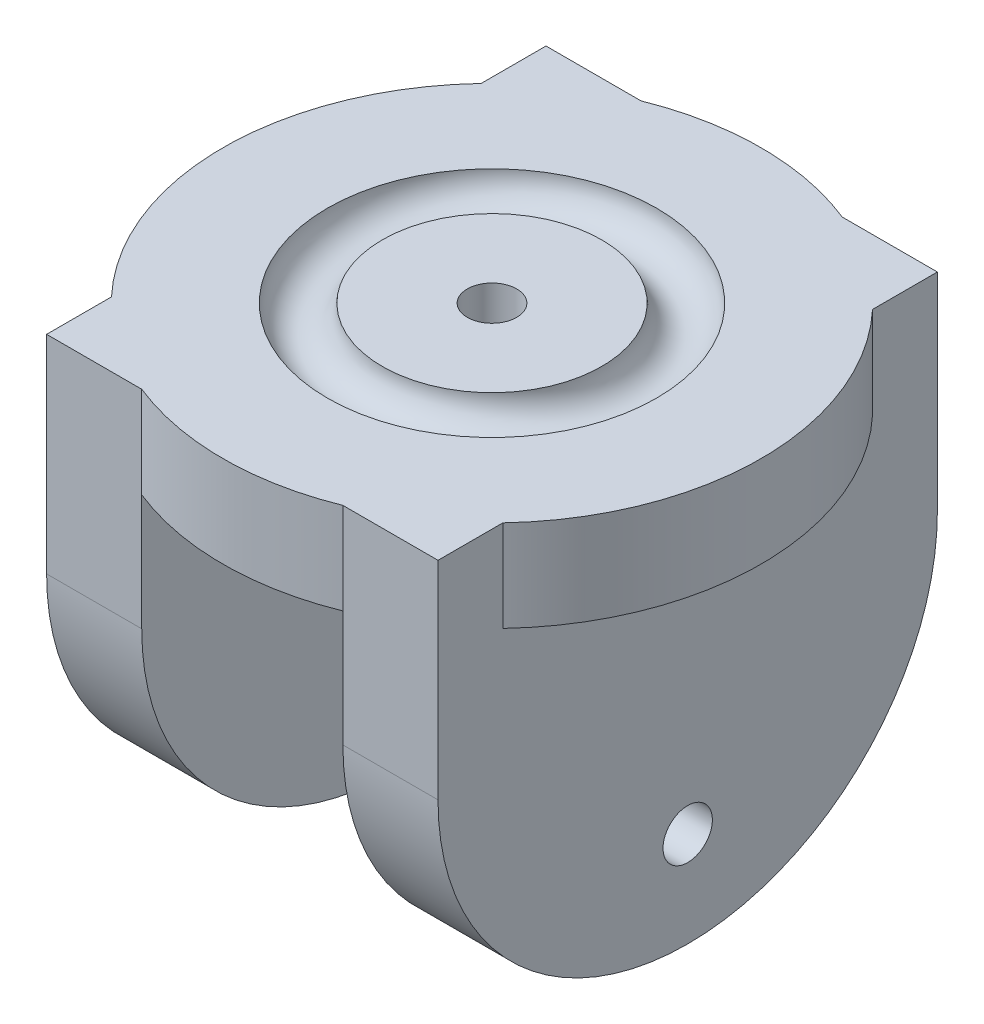
ISO-10303-21;
HEADER;
FILE_DESCRIPTION(('STEP AP214'),'2;1');
FILE_NAME('part.step','',(''),(''),'','','');
FILE_SCHEMA(('AUTOMOTIVE_DESIGN { 1 0 10303 214 1 1 1 1 }'));
ENDSEC;
DATA;
#1=APPLICATION_CONTEXT('core data for automotive mechanical design processes');
#2=APPLICATION_PROTOCOL_DEFINITION('international standard','automotive_design',2000,#1);
#3=PRODUCT_CONTEXT('',#1,'mechanical');
#4=PRODUCT('Part','Part','',(#3));
#5=PRODUCT_RELATED_PRODUCT_CATEGORY('part','',(#4));
#6=PRODUCT_DEFINITION_FORMATION('','',#4);
#7=PRODUCT_DEFINITION_CONTEXT('part definition',#1,'design');
#8=PRODUCT_DEFINITION('design','',#6,#7);
#9=PRODUCT_DEFINITION_SHAPE('','',#8);
#10=(LENGTH_UNIT() NAMED_UNIT(*) SI_UNIT(.MILLI.,.METRE.));
#11=(NAMED_UNIT(*) PLANE_ANGLE_UNIT() SI_UNIT($,.RADIAN.));
#12=(NAMED_UNIT(*) SI_UNIT($,.STERADIAN.) SOLID_ANGLE_UNIT());
#13=UNCERTAINTY_MEASURE_WITH_UNIT(LENGTH_MEASURE(1.E-05),#10,'distance_accuracy_value','');
#14=(GEOMETRIC_REPRESENTATION_CONTEXT(3) GLOBAL_UNCERTAINTY_ASSIGNED_CONTEXT((#13)) GLOBAL_UNIT_ASSIGNED_CONTEXT((#10,
#11,#12)) REPRESENTATION_CONTEXT('',''));
#15=CARTESIAN_POINT('',(0.,0.,0.));
#16=DIRECTION('',(0.,0.,1.));
#17=DIRECTION('',(1.,0.,0.));
#18=AXIS2_PLACEMENT_3D('',#15,#16,#17);
#19=CARTESIAN_POINT('',(-11.,65.5996002706022,-27.3088133507909));
#20=DIRECTION('',(1.,0.,0.));
#21=DIRECTION('',(0.,0.,-1.));
#22=AXIS2_PLACEMENT_3D('',#19,#20,#21);
#23=PLANE('',#22);
#24=CARTESIAN_POINT('',(-11.,-29.5844424914264,0.));
#25=DIRECTION('',(1.,0.,0.));
#26=DIRECTION('',(0.,0.,-1.));
#27=AXIS2_PLACEMENT_3D('',#24,#25,#26);
#28=CIRCLE('',#27,2.7);
#29=CARTESIAN_POINT('',(-11.,-29.5844424914264,-2.7));
#30=VERTEX_POINT('',#29);
#31=EDGE_CURVE('E366',#30,#30,#28,.T.);
#32=ORIENTED_EDGE('',*,*,#31,.F.);
#33=EDGE_LOOP('',(#32));
#34=FACE_BOUND('',#33,.T.);
#35=CARTESIAN_POINT('',(-11.,-12.691186649209,0.));
#36=DIRECTION('',(1.,0.,0.));
#37=DIRECTION('',(0.,0.,-1.));
#38=AXIS2_PLACEMENT_3D('',#35,#36,#37);
#39=CIRCLE('',#38,27.308813350791);
#40=CARTESIAN_POINT('',(-11.,-12.691186649209,-27.3088133507909));
#41=VERTEX_POINT('',#40);
#42=CARTESIAN_POINT('',(-11.,-12.691186649209,27.3088133507911));
#43=VERTEX_POINT('',#42);
#44=EDGE_CURVE('E141',#41,#43,#39,.F.);
#45=ORIENTED_EDGE('',*,*,#44,.F.);
#46=DIRECTION('',(0.,-1.,0.));
#47=VECTOR('',#46,1.);
#48=CARTESIAN_POINT('',(-11.,65.5996002706022,-27.3088133507909));
#49=LINE('',#48,#47);
#50=CARTESIAN_POINT('',(-11.,0.,-27.3088133507909));
#51=VERTEX_POINT('',#50);
#52=EDGE_CURVE('E177',#51,#41,#49,.T.);
#53=ORIENTED_EDGE('',*,*,#52,.F.);
#54=DIRECTION('',(0.,0.,-1.));
#55=VECTOR('',#54,1.);
#56=CARTESIAN_POINT('',(-11.,0.,0.));
#57=LINE('',#56,#55);
#58=CARTESIAN_POINT('',(-11.,0.,27.3088133507911));
#59=VERTEX_POINT('',#58);
#60=EDGE_CURVE('E198',#59,#51,#57,.T.);
#61=ORIENTED_EDGE('',*,*,#60,.F.);
#62=DIRECTION('',(0.,-1.,0.));
#63=VECTOR('',#62,1.);
#64=CARTESIAN_POINT('',(-11.,65.5996002706022,27.3088133507911));
#65=LINE('',#64,#63);
#66=EDGE_CURVE('E172',#59,#43,#65,.T.);
#67=ORIENTED_EDGE('',*,*,#66,.T.);
#68=EDGE_LOOP('',(#45,#53,#61,#67));
#69=FACE_BOUND('',#68,.T.);
#70=ADVANCED_FACE('F33',(#34,#69),#23,.T.);
#71=CARTESIAN_POINT('',(-21.403384244436,65.5996002706022,27.3088133507911));
#72=DIRECTION('',(-1.,0.,0.));
#73=DIRECTION('',(0.,0.,1.));
#74=AXIS2_PLACEMENT_3D('',#71,#72,#73);
#75=PLANE('',#74);
#76=CARTESIAN_POINT('',(-21.403384244436,-29.5844424914264,0.));
#77=DIRECTION('',(-1.,0.,0.));
#78=DIRECTION('',(0.,0.,1.));
#79=AXIS2_PLACEMENT_3D('',#76,#77,#78);
#80=CIRCLE('',#79,2.7);
#81=CARTESIAN_POINT('',(-21.403384244436,-29.5844424914264,2.7));
#82=VERTEX_POINT('',#81);
#83=EDGE_CURVE('E204',#82,#82,#80,.T.);
#84=ORIENTED_EDGE('',*,*,#83,.F.);
#85=EDGE_LOOP('',(#84));
#86=FACE_BOUND('',#85,.T.);
#87=CARTESIAN_POINT('',(-21.403384244436,-12.691186649209,0.));
#88=DIRECTION('',(1.,0.,0.));
#89=DIRECTION('',(0.,0.,1.));
#90=AXIS2_PLACEMENT_3D('',#87,#88,#89);
#91=CIRCLE('',#90,27.308813350791);
#92=CARTESIAN_POINT('',(-21.403384244436,-12.691186649209,27.3088133507911));
#93=VERTEX_POINT('',#92);
#94=CARTESIAN_POINT('',(-21.403384244436,-12.691186649209,-27.3088133507909));
#95=VERTEX_POINT('',#94);
#96=EDGE_CURVE('E48',#93,#95,#91,.T.);
#97=ORIENTED_EDGE('',*,*,#96,.F.);
#98=DIRECTION('',(0.,-1.,0.));
#99=VECTOR('',#98,1.);
#100=CARTESIAN_POINT('',(-21.403384244436,65.5996002706022,27.3088133507911));
#101=LINE('',#100,#99);
#102=CARTESIAN_POINT('',(-21.403384244436,10.,27.3088133507911));
#103=VERTEX_POINT('',#102);
#104=EDGE_CURVE('E153',#103,#93,#101,.T.);
#105=ORIENTED_EDGE('',*,*,#104,.F.);
#106=DIRECTION('',(0.,0.,-1.));
#107=VECTOR('',#106,1.);
#108=CARTESIAN_POINT('',(-21.403384244436,10.,27.3088133507911));
#109=LINE('',#108,#107);
#110=CARTESIAN_POINT('',(-21.403384244436,10.,20.2154997344455));
#111=VERTEX_POINT('',#110);
#112=EDGE_CURVE('E164',#103,#111,#109,.T.);
#113=ORIENTED_EDGE('',*,*,#112,.T.);
#114=DIRECTION('',(0.,-1.,0.));
#115=VECTOR('',#114,1.);
#116=CARTESIAN_POINT('',(-21.403384244436,10.,20.2154997344455));
#117=LINE('',#116,#115);
#118=CARTESIAN_POINT('',(-21.403384244436,0.,20.2154997344455));
#119=VERTEX_POINT('',#118);
#120=EDGE_CURVE('E176',#119,#111,#117,.F.);
#121=ORIENTED_EDGE('',*,*,#120,.F.);
#122=DIRECTION('',(0.,0.,1.));
#123=VECTOR('',#122,1.);
#124=CARTESIAN_POINT('',(-21.403384244436,0.,0.));
#125=LINE('',#124,#123);
#126=CARTESIAN_POINT('',(-21.403384244436,0.,-20.2154997344455));
#127=VERTEX_POINT('',#126);
#128=EDGE_CURVE('E195',#127,#119,#125,.T.);
#129=ORIENTED_EDGE('',*,*,#128,.F.);
#130=DIRECTION('',(0.,-1.,0.));
#131=VECTOR('',#130,1.);
#132=CARTESIAN_POINT('',(-21.403384244436,10.,-20.2154997344455));
#133=LINE('',#132,#131);
#134=CARTESIAN_POINT('',(-21.403384244436,10.,-20.2154997344455));
#135=VERTEX_POINT('',#134);
#136=EDGE_CURVE('E180',#135,#127,#133,.T.);
#137=ORIENTED_EDGE('',*,*,#136,.F.);
#138=CARTESIAN_POINT('',(-21.403384244436,10.,-27.3088133507909));
#139=VERTEX_POINT('',#138);
#140=EDGE_CURVE('E162',#135,#139,#109,.T.);
#141=ORIENTED_EDGE('',*,*,#140,.T.);
#142=DIRECTION('',(0.,-1.,0.));
#143=VECTOR('',#142,1.);
#144=CARTESIAN_POINT('',(-21.403384244436,65.5996002706022,-27.3088133507909));
#145=LINE('',#144,#143);
#146=EDGE_CURVE('E156',#139,#95,#145,.T.);
#147=ORIENTED_EDGE('',*,*,#146,.T.);
#148=EDGE_LOOP('',(#97,#105,#113,#121,#129,#137,#141,#147));
#149=FACE_BOUND('',#148,.T.);
#150=ADVANCED_FACE('F152',(#86,#149),#75,.T.);
#151=CARTESIAN_POINT('',(21.403384244436,65.5996002706022,27.308813350791));
#152=DIRECTION('',(1.,0.,0.));
#153=DIRECTION('',(0.,0.,-1.));
#154=AXIS2_PLACEMENT_3D('',#151,#152,#153);
#155=PLANE('',#154);
#156=CARTESIAN_POINT('',(21.403384244436,-29.5844424914264,0.));
#157=DIRECTION('',(1.,0.,0.));
#158=DIRECTION('',(0.,0.,-1.));
#159=AXIS2_PLACEMENT_3D('',#156,#157,#158);
#160=CIRCLE('',#159,2.7);
#161=CARTESIAN_POINT('',(21.403384244436,-29.5844424914264,-2.7));
#162=VERTEX_POINT('',#161);
#163=EDGE_CURVE('E205',#162,#162,#160,.T.);
#164=ORIENTED_EDGE('',*,*,#163,.F.);
#165=EDGE_LOOP('',(#164));
#166=FACE_BOUND('',#165,.T.);
#167=CARTESIAN_POINT('',(21.403384244436,-12.691186649209,0.));
#168=DIRECTION('',(1.,0.,0.));
#169=DIRECTION('',(0.,0.,-1.));
#170=AXIS2_PLACEMENT_3D('',#167,#168,#169);
#171=CIRCLE('',#170,27.308813350791);
#172=CARTESIAN_POINT('',(21.403384244436,-12.691186649209,-27.3088133507909));
#173=VERTEX_POINT('',#172);
#174=CARTESIAN_POINT('',(21.403384244436,-12.691186649209,27.3088133507911));
#175=VERTEX_POINT('',#174);
#176=EDGE_CURVE('E282',#173,#175,#171,.F.);
#177=ORIENTED_EDGE('',*,*,#176,.F.);
#178=DIRECTION('',(0.,-1.,0.));
#179=VECTOR('',#178,1.);
#180=CARTESIAN_POINT('',(21.403384244436,65.5996002706022,-27.308813350791));
#181=LINE('',#180,#179);
#182=CARTESIAN_POINT('',(21.403384244436,10.,-27.308813350791));
#183=VERTEX_POINT('',#182);
#184=EDGE_CURVE('E306',#183,#173,#181,.T.);
#185=ORIENTED_EDGE('',*,*,#184,.F.);
#186=DIRECTION('',(0.,0.,1.));
#187=VECTOR('',#186,1.);
#188=CARTESIAN_POINT('',(21.403384244436,10.,27.308813350791));
#189=LINE('',#188,#187);
#190=CARTESIAN_POINT('',(21.403384244436,10.,-20.2154997344455));
#191=VERTEX_POINT('',#190);
#192=EDGE_CURVE('E298',#183,#191,#189,.T.);
#193=ORIENTED_EDGE('',*,*,#192,.T.);
#194=DIRECTION('',(0.,-1.,0.));
#195=VECTOR('',#194,1.);
#196=CARTESIAN_POINT('',(21.403384244436,10.,-20.2154997344455));
#197=LINE('',#196,#195);
#198=CARTESIAN_POINT('',(21.403384244436,0.,-20.2154997344455));
#199=VERTEX_POINT('',#198);
#200=EDGE_CURVE('E315',#199,#191,#197,.F.);
#201=ORIENTED_EDGE('',*,*,#200,.F.);
#202=DIRECTION('',(0.,0.,-1.));
#203=VECTOR('',#202,1.);
#204=CARTESIAN_POINT('',(21.403384244436,0.,0.));
#205=LINE('',#204,#203);
#206=CARTESIAN_POINT('',(21.403384244436,0.,20.2154997344455));
#207=VERTEX_POINT('',#206);
#208=EDGE_CURVE('E312',#207,#199,#205,.T.);
#209=ORIENTED_EDGE('',*,*,#208,.F.);
#210=DIRECTION('',(0.,-1.,0.));
#211=VECTOR('',#210,1.);
#212=CARTESIAN_POINT('',(21.403384244436,10.,20.2154997344455));
#213=LINE('',#212,#211);
#214=CARTESIAN_POINT('',(21.403384244436,10.,20.2154997344455));
#215=VERTEX_POINT('',#214);
#216=EDGE_CURVE('E318',#215,#207,#213,.T.);
#217=ORIENTED_EDGE('',*,*,#216,.F.);
#218=CARTESIAN_POINT('',(21.403384244436,10.,27.308813350791));
#219=VERTEX_POINT('',#218);
#220=EDGE_CURVE('E295',#215,#219,#189,.T.);
#221=ORIENTED_EDGE('',*,*,#220,.T.);
#222=DIRECTION('',(0.,-1.,0.));
#223=VECTOR('',#222,1.);
#224=CARTESIAN_POINT('',(21.403384244436,65.5996002706022,27.308813350791));
#225=LINE('',#224,#223);
#226=EDGE_CURVE('E291',#219,#175,#225,.T.);
#227=ORIENTED_EDGE('',*,*,#226,.T.);
#228=EDGE_LOOP('',(#177,#185,#193,#201,#209,#217,#221,#227));
#229=FACE_BOUND('',#228,.T.);
#230=ADVANCED_FACE('F236',(#166,#229),#155,.T.);
#231=CARTESIAN_POINT('',(11.,65.5996002706022,-27.308813350791));
#232=DIRECTION('',(-1.,0.,0.));
#233=DIRECTION('',(0.,0.,1.));
#234=AXIS2_PLACEMENT_3D('',#231,#232,#233);
#235=PLANE('',#234);
#236=CARTESIAN_POINT('',(11.,-29.5844424914264,0.));
#237=DIRECTION('',(-1.,0.,0.));
#238=DIRECTION('',(0.,0.,1.));
#239=AXIS2_PLACEMENT_3D('',#236,#237,#238);
#240=CIRCLE('',#239,2.7);
#241=CARTESIAN_POINT('',(11.,-29.5844424914264,2.7));
#242=VERTEX_POINT('',#241);
#243=EDGE_CURVE('E201',#242,#242,#240,.T.);
#244=ORIENTED_EDGE('',*,*,#243,.F.);
#245=EDGE_LOOP('',(#244));
#246=FACE_BOUND('',#245,.T.);
#247=CARTESIAN_POINT('',(11.,-12.691186649209,0.));
#248=DIRECTION('',(-1.,0.,0.));
#249=DIRECTION('',(0.,0.,1.));
#250=AXIS2_PLACEMENT_3D('',#247,#248,#249);
#251=CIRCLE('',#250,27.308813350791);
#252=CARTESIAN_POINT('',(11.,-12.691186649209,27.3088133507911));
#253=VERTEX_POINT('',#252);
#254=CARTESIAN_POINT('',(11.,-12.691186649209,-27.308813350791));
#255=VERTEX_POINT('',#254);
#256=EDGE_CURVE('E56',#253,#255,#251,.F.);
#257=ORIENTED_EDGE('',*,*,#256,.F.);
#258=DIRECTION('',(0.,-1.,0.));
#259=VECTOR('',#258,1.);
#260=CARTESIAN_POINT('',(11.,65.5996002706022,27.308813350791));
#261=LINE('',#260,#259);
#262=CARTESIAN_POINT('',(11.,0.,27.3088133507909));
#263=VERTEX_POINT('',#262);
#264=EDGE_CURVE('E293',#263,#253,#261,.T.);
#265=ORIENTED_EDGE('',*,*,#264,.F.);
#266=DIRECTION('',(0.,0.,1.));
#267=VECTOR('',#266,1.);
#268=CARTESIAN_POINT('',(11.,0.,0.));
#269=LINE('',#268,#267);
#270=CARTESIAN_POINT('',(11.,0.,-27.308813350791));
#271=VERTEX_POINT('',#270);
#272=EDGE_CURVE('E308',#271,#263,#269,.T.);
#273=ORIENTED_EDGE('',*,*,#272,.F.);
#274=DIRECTION('',(0.,-1.,0.));
#275=VECTOR('',#274,1.);
#276=CARTESIAN_POINT('',(11.,65.5996002706022,-27.308813350791));
#277=LINE('',#276,#275);
#278=EDGE_CURVE('E351',#271,#255,#277,.T.);
#279=ORIENTED_EDGE('',*,*,#278,.T.);
#280=EDGE_LOOP('',(#257,#265,#273,#279));
#281=FACE_BOUND('',#280,.T.);
#282=ADVANCED_FACE('F227',(#246,#281),#235,.T.);
#283=CARTESIAN_POINT('',(0.,10.,0.));
#284=DIRECTION('',(0.,1.,0.));
#285=DIRECTION('',(0.,0.,1.));
#286=AXIS2_PLACEMENT_3D('',#283,#284,#285);
#287=PLANE('',#286);
#288=CARTESIAN_POINT('',(0.,10.,0.));
#289=DIRECTION('',(0.,1.,0.));
#290=DIRECTION('',(0.,0.,1.));
#291=AXIS2_PLACEMENT_3D('',#288,#289,#290);
#292=CIRCLE('',#291,29.4409797158372);
#293=CARTESIAN_POINT('',(-11.,10.,27.3088133507911));
#294=VERTEX_POINT('',#293);
#295=CARTESIAN_POINT('',(11.,10.,27.308813350791));
#296=VERTEX_POINT('',#295);
#297=EDGE_CURVE('E184',#294,#296,#292,.T.);
#298=ORIENTED_EDGE('',*,*,#297,.T.);
#299=DIRECTION('',(-1.,0.,0.));
#300=VECTOR('',#299,1.);
#301=CARTESIAN_POINT('',(11.,10.,27.308813350791));
#302=LINE('',#301,#300);
#303=EDGE_CURVE('E297',#219,#296,#302,.T.);
#304=ORIENTED_EDGE('',*,*,#303,.F.);
#305=ORIENTED_EDGE('',*,*,#220,.F.);
#306=EDGE_CURVE('E188',#215,#191,#292,.T.);
#307=ORIENTED_EDGE('',*,*,#306,.T.);
#308=ORIENTED_EDGE('',*,*,#192,.F.);
#309=DIRECTION('',(1.,0.,0.));
#310=VECTOR('',#309,1.);
#311=CARTESIAN_POINT('',(21.403384244436,10.,-27.308813350791));
#312=LINE('',#311,#310);
#313=CARTESIAN_POINT('',(11.,10.,-27.308813350791));
#314=VERTEX_POINT('',#313);
#315=EDGE_CURVE('E309',#314,#183,#312,.T.);
#316=ORIENTED_EDGE('',*,*,#315,.F.);
#317=CARTESIAN_POINT('',(-11.,10.,-27.3088133507909));
#318=VERTEX_POINT('',#317);
#319=EDGE_CURVE('E189',#314,#318,#292,.T.);
#320=ORIENTED_EDGE('',*,*,#319,.T.);
#321=DIRECTION('',(1.,0.,0.));
#322=VECTOR('',#321,1.);
#323=CARTESIAN_POINT('',(-21.403384244436,10.,-27.3088133507909));
#324=LINE('',#323,#322);
#325=EDGE_CURVE('E321',#139,#318,#324,.T.);
#326=ORIENTED_EDGE('',*,*,#325,.F.);
#327=ORIENTED_EDGE('',*,*,#140,.F.);
#328=EDGE_CURVE('E187',#135,#111,#292,.T.);
#329=ORIENTED_EDGE('',*,*,#328,.T.);
#330=ORIENTED_EDGE('',*,*,#112,.F.);
#331=DIRECTION('',(-1.,0.,0.));
#332=VECTOR('',#331,1.);
#333=CARTESIAN_POINT('',(-11.,10.,27.3088133507911));
#334=LINE('',#333,#332);
#335=EDGE_CURVE('E161',#294,#103,#334,.T.);
#336=ORIENTED_EDGE('',*,*,#335,.F.);
#337=EDGE_LOOP('',(#298,#304,#305,#307,#308,#316,#320,#326,#327,#329,#330,#336));
#338=FACE_BOUND('',#337,.T.);
#339=CARTESIAN_POINT('',(0.,10.,0.));
#340=DIRECTION('',(0.,1.,0.));
#341=DIRECTION('',(0.,0.,1.));
#342=AXIS2_PLACEMENT_3D('',#339,#340,#341);
#343=CIRCLE('',#342,18.);
#344=CARTESIAN_POINT('',(-18.,10.,0.));
#345=VERTEX_POINT('',#344);
#346=EDGE_CURVE('E11',#345,#345,#343,.T.);
#347=ORIENTED_EDGE('',*,*,#346,.F.);
#348=EDGE_LOOP('',(#347));
#349=FACE_BOUND('',#348,.T.);
#350=ADVANCED_FACE('F218',(#338,#349),#287,.T.);
#351=CARTESIAN_POINT('',(0.,9.99999999999999,0.));
#352=DIRECTION('',(0.,1.,0.));
#353=DIRECTION('',(0.,0.,1.));
#354=AXIS2_PLACEMENT_3D('',#351,#352,#353);
#355=CIRCLE('',#354,2.7);
#356=CARTESIAN_POINT('',(0.,9.99999999999999,2.7));
#357=VERTEX_POINT('',#356);
#358=EDGE_CURVE('E206',#357,#357,#355,.T.);
#359=ORIENTED_EDGE('',*,*,#358,.F.);
#360=EDGE_LOOP('',(#359));
#361=FACE_BOUND('',#360,.T.);
#362=CARTESIAN_POINT('',(0.,10.,0.));
#363=DIRECTION('',(0.,-1.,0.));
#364=DIRECTION('',(0.,0.,-1.));
#365=AXIS2_PLACEMENT_3D('',#362,#363,#364);
#366=CIRCLE('',#365,12.);
#367=CARTESIAN_POINT('',(-12.,10.,0.));
#368=VERTEX_POINT('',#367);
#369=EDGE_CURVE('E41',#368,#368,#366,.T.);
#370=ORIENTED_EDGE('',*,*,#369,.F.);
#371=EDGE_LOOP('',(#370));
#372=FACE_BOUND('',#371,.T.);
#373=ADVANCED_FACE('F215',(#361,#372),#287,.T.);
#374=CARTESIAN_POINT('',(0.,10.,0.));
#375=DIRECTION('',(0.,-1.,0.));
#376=DIRECTION('',(0.,0.,-1.));
#377=AXIS2_PLACEMENT_3D('',#374,#375,#376);
#378=CYLINDRICAL_SURFACE('',#377,29.4409797158372);
#379=ORIENTED_EDGE('',*,*,#306,.F.);
#380=ORIENTED_EDGE('',*,*,#216,.T.);
#381=CARTESIAN_POINT('',(0.,0.,0.));
#382=DIRECTION('',(0.,1.,0.));
#383=DIRECTION('',(0.,0.,1.));
#384=AXIS2_PLACEMENT_3D('',#381,#382,#383);
#385=CIRCLE('',#384,29.4409797158372);
#386=EDGE_CURVE('E194',#207,#199,#385,.T.);
#387=ORIENTED_EDGE('',*,*,#386,.T.);
#388=ORIENTED_EDGE('',*,*,#200,.T.);
#389=EDGE_LOOP('',(#379,#380,#387,#388));
#390=FACE_BOUND('',#389,.T.);
#391=ADVANCED_FACE('F217',(#390),#378,.T.);
#392=EDGE_CURVE('E190',#59,#263,#385,.T.);
#393=ORIENTED_EDGE('',*,*,#392,.T.);
#394=EDGE_CURVE('E304',#296,#263,#261,.T.);
#395=ORIENTED_EDGE('',*,*,#394,.F.);
#396=ORIENTED_EDGE('',*,*,#297,.F.);
#397=EDGE_CURVE('E166',#294,#59,#65,.T.);
#398=ORIENTED_EDGE('',*,*,#397,.T.);
#399=EDGE_LOOP('',(#393,#395,#396,#398));
#400=FACE_BOUND('',#399,.T.);
#401=ADVANCED_FACE('F225',(#400),#378,.T.);
#402=CARTESIAN_POINT('',(0.,0.,0.));
#403=DIRECTION('',(0.,1.,0.));
#404=DIRECTION('',(0.,0.,1.));
#405=AXIS2_PLACEMENT_3D('',#402,#403,#404);
#406=PLANE('',#405);
#407=ORIENTED_EDGE('',*,*,#386,.F.);
#408=ORIENTED_EDGE('',*,*,#208,.T.);
#409=EDGE_LOOP('',(#407,#408));
#410=FACE_BOUND('',#409,.T.);
#411=ADVANCED_FACE('F371',(#410),#406,.F.);
#412=ORIENTED_EDGE('',*,*,#319,.F.);
#413=EDGE_CURVE('E343',#314,#271,#277,.T.);
#414=ORIENTED_EDGE('',*,*,#413,.T.);
#415=EDGE_CURVE('E183',#271,#51,#385,.T.);
#416=ORIENTED_EDGE('',*,*,#415,.T.);
#417=EDGE_CURVE('E173',#318,#51,#49,.T.);
#418=ORIENTED_EDGE('',*,*,#417,.F.);
#419=EDGE_LOOP('',(#412,#414,#416,#418));
#420=FACE_BOUND('',#419,.T.);
#421=ADVANCED_FACE('F341',(#420),#378,.T.);
#422=CARTESIAN_POINT('',(0.,0.,0.));
#423=DIRECTION('',(0.,1.,0.));
#424=DIRECTION('',(0.,0.,1.));
#425=AXIS2_PLACEMENT_3D('',#422,#423,#424);
#426=CIRCLE('',#425,2.7);
#427=CARTESIAN_POINT('',(0.,0.,2.7));
#428=VERTEX_POINT('',#427);
#429=EDGE_CURVE('E208',#428,#428,#426,.T.);
#430=ORIENTED_EDGE('',*,*,#429,.T.);
#431=EDGE_LOOP('',(#430));
#432=FACE_BOUND('',#431,.T.);
#433=ORIENTED_EDGE('',*,*,#415,.F.);
#434=ORIENTED_EDGE('',*,*,#272,.T.);
#435=ORIENTED_EDGE('',*,*,#392,.F.);
#436=ORIENTED_EDGE('',*,*,#60,.T.);
#437=EDGE_LOOP('',(#433,#434,#435,#436));
#438=FACE_BOUND('',#437,.T.);
#439=ADVANCED_FACE('F347',(#432,#438),#406,.F.);
#440=ORIENTED_EDGE('',*,*,#328,.F.);
#441=ORIENTED_EDGE('',*,*,#136,.T.);
#442=EDGE_CURVE('E193',#127,#119,#385,.T.);
#443=ORIENTED_EDGE('',*,*,#442,.T.);
#444=ORIENTED_EDGE('',*,*,#120,.T.);
#445=EDGE_LOOP('',(#440,#441,#443,#444));
#446=FACE_BOUND('',#445,.T.);
#447=ADVANCED_FACE('F35',(#446),#378,.T.);
#448=ORIENTED_EDGE('',*,*,#442,.F.);
#449=ORIENTED_EDGE('',*,*,#128,.T.);
#450=EDGE_LOOP('',(#448,#449));
#451=FACE_BOUND('',#450,.T.);
#452=ADVANCED_FACE('F244',(#451),#406,.F.);
#453=CARTESIAN_POINT('',(-11.,65.5996002706022,27.3088133507911));
#454=DIRECTION('',(0.,0.,1.));
#455=DIRECTION('',(1.,0.,0.));
#456=AXIS2_PLACEMENT_3D('',#453,#454,#455);
#457=PLANE('',#456);
#458=DIRECTION('',(-1.,0.,0.));
#459=VECTOR('',#458,1.);
#460=CARTESIAN_POINT('',(58.596615755564,-12.691186649209,27.3088133507911));
#461=LINE('',#460,#459);
#462=EDGE_CURVE('E138',#43,#93,#461,.T.);
#463=ORIENTED_EDGE('',*,*,#462,.F.);
#464=ORIENTED_EDGE('',*,*,#66,.F.);
#465=ORIENTED_EDGE('',*,*,#397,.F.);
#466=ORIENTED_EDGE('',*,*,#335,.T.);
#467=ORIENTED_EDGE('',*,*,#104,.T.);
#468=EDGE_LOOP('',(#463,#464,#465,#466,#467));
#469=FACE_BOUND('',#468,.T.);
#470=ADVANCED_FACE('F159',(#469),#457,.T.);
#471=CARTESIAN_POINT('',(-21.403384244436,65.5996002706022,-27.3088133507909));
#472=DIRECTION('',(0.,0.,-1.));
#473=DIRECTION('',(-1.,0.,0.));
#474=AXIS2_PLACEMENT_3D('',#471,#472,#473);
#475=PLANE('',#474);
#476=DIRECTION('',(-1.,0.,0.));
#477=VECTOR('',#476,1.);
#478=CARTESIAN_POINT('',(58.596615755564,-12.691186649209,-27.3088133507909));
#479=LINE('',#478,#477);
#480=EDGE_CURVE('E157',#41,#95,#479,.T.);
#481=ORIENTED_EDGE('',*,*,#480,.T.);
#482=ORIENTED_EDGE('',*,*,#146,.F.);
#483=ORIENTED_EDGE('',*,*,#325,.T.);
#484=ORIENTED_EDGE('',*,*,#417,.T.);
#485=ORIENTED_EDGE('',*,*,#52,.T.);
#486=EDGE_LOOP('',(#481,#482,#483,#484,#485));
#487=FACE_BOUND('',#486,.T.);
#488=ADVANCED_FACE('F243',(#487),#475,.T.);
#489=CARTESIAN_POINT('',(11.,65.5996002706022,27.308813350791));
#490=DIRECTION('',(0.,0.,1.));
#491=DIRECTION('',(1.,0.,0.));
#492=AXIS2_PLACEMENT_3D('',#489,#490,#491);
#493=PLANE('',#492);
#494=EDGE_CURVE('E146',#175,#253,#461,.T.);
#495=ORIENTED_EDGE('',*,*,#494,.F.);
#496=ORIENTED_EDGE('',*,*,#226,.F.);
#497=ORIENTED_EDGE('',*,*,#303,.T.);
#498=ORIENTED_EDGE('',*,*,#394,.T.);
#499=ORIENTED_EDGE('',*,*,#264,.T.);
#500=EDGE_LOOP('',(#495,#496,#497,#498,#499));
#501=FACE_BOUND('',#500,.T.);
#502=ADVANCED_FACE('F248',(#501),#493,.T.);
#503=CARTESIAN_POINT('',(21.403384244436,65.5996002706022,-27.308813350791));
#504=DIRECTION('',(0.,0.,-1.));
#505=DIRECTION('',(-1.,0.,0.));
#506=AXIS2_PLACEMENT_3D('',#503,#504,#505);
#507=PLANE('',#506);
#508=EDGE_CURVE('E147',#173,#255,#479,.T.);
#509=ORIENTED_EDGE('',*,*,#508,.T.);
#510=ORIENTED_EDGE('',*,*,#278,.F.);
#511=ORIENTED_EDGE('',*,*,#413,.F.);
#512=ORIENTED_EDGE('',*,*,#315,.T.);
#513=ORIENTED_EDGE('',*,*,#184,.T.);
#514=EDGE_LOOP('',(#509,#510,#511,#512,#513));
#515=FACE_BOUND('',#514,.T.);
#516=ADVANCED_FACE('F255',(#515),#507,.T.);
#517=CARTESIAN_POINT('',(-58.596615755564,-29.5844424914264,0.));
#518=DIRECTION('',(1.,0.,0.));
#519=DIRECTION('',(0.,0.,-1.));
#520=AXIS2_PLACEMENT_3D('',#517,#518,#519);
#521=CYLINDRICAL_SURFACE('',#520,2.7);
#522=ORIENTED_EDGE('',*,*,#243,.T.);
#523=EDGE_LOOP('',(#522));
#524=FACE_BOUND('',#523,.T.);
#525=ORIENTED_EDGE('',*,*,#163,.T.);
#526=EDGE_LOOP('',(#525));
#527=FACE_BOUND('',#526,.T.);
#528=ADVANCED_FACE('F262',(#524,#527),#521,.F.);
#529=ORIENTED_EDGE('',*,*,#31,.T.);
#530=EDGE_LOOP('',(#529));
#531=FACE_BOUND('',#530,.T.);
#532=ORIENTED_EDGE('',*,*,#83,.T.);
#533=EDGE_LOOP('',(#532));
#534=FACE_BOUND('',#533,.T.);
#535=ADVANCED_FACE('F266',(#531,#534),#521,.F.);
#536=CARTESIAN_POINT('',(0.,-70.,0.));
#537=DIRECTION('',(0.,1.,0.));
#538=DIRECTION('',(0.,0.,1.));
#539=AXIS2_PLACEMENT_3D('',#536,#537,#538);
#540=CYLINDRICAL_SURFACE('',#539,2.7);
#541=ORIENTED_EDGE('',*,*,#358,.T.);
#542=EDGE_LOOP('',(#541));
#543=FACE_BOUND('',#542,.T.);
#544=ORIENTED_EDGE('',*,*,#429,.F.);
#545=EDGE_LOOP('',(#544));
#546=FACE_BOUND('',#545,.T.);
#547=ADVANCED_FACE('F268',(#543,#546),#540,.F.);
#548=CARTESIAN_POINT('',(0.,10.,0.));
#549=DIRECTION('',(0.,1.,0.));
#550=DIRECTION('',(0.,0.,1.));
#551=AXIS2_PLACEMENT_3D('',#548,#549,#550);
#552=TOROIDAL_SURFACE('',#551,15.,3.);
#553=ORIENTED_EDGE('',*,*,#346,.T.);
#554=CARTESIAN_POINT('',(-15.,10.,0.));
#555=DIRECTION('',(0.,0.,1.));
#556=DIRECTION('',(1.,0.,0.));
#557=AXIS2_PLACEMENT_3D('',#554,#555,#556);
#558=CIRCLE('',#557,3.);
#559=EDGE_CURVE('E209',#345,#368,#558,.T.);
#560=ORIENTED_EDGE('',*,*,#559,.T.);
#561=ORIENTED_EDGE('',*,*,#369,.T.);
#562=ORIENTED_EDGE('',*,*,#559,.F.);
#563=EDGE_LOOP('',(#553,#560,#561,#562));
#564=FACE_BOUND('',#563,.T.);
#565=ADVANCED_FACE('F213',(#564),#552,.F.);
#566=CARTESIAN_POINT('',(58.596615755564,-12.691186649209,0.));
#567=DIRECTION('',(-1.,0.,0.));
#568=DIRECTION('',(0.,0.,1.));
#569=AXIS2_PLACEMENT_3D('',#566,#567,#568);
#570=CYLINDRICAL_SURFACE('',#569,27.308813350791);
#571=ORIENTED_EDGE('',*,*,#176,.T.);
#572=ORIENTED_EDGE('',*,*,#494,.T.);
#573=ORIENTED_EDGE('',*,*,#256,.T.);
#574=ORIENTED_EDGE('',*,*,#508,.F.);
#575=EDGE_LOOP('',(#571,#572,#573,#574));
#576=FACE_BOUND('',#575,.T.);
#577=ADVANCED_FACE('F274',(#576),#570,.T.);
#578=ORIENTED_EDGE('',*,*,#44,.T.);
#579=ORIENTED_EDGE('',*,*,#462,.T.);
#580=ORIENTED_EDGE('',*,*,#96,.T.);
#581=ORIENTED_EDGE('',*,*,#480,.F.);
#582=EDGE_LOOP('',(#578,#579,#580,#581));
#583=FACE_BOUND('',#582,.T.);
#584=ADVANCED_FACE('F139',(#583),#570,.T.);
#585=CLOSED_SHELL('',(#70,#150,#230,#282,#350,#373,#391,#401,#411,#421,#439,#447,#452,#470,#488,
#502,#516,#528,#535,#547,#565,#577,#584));
#586=MANIFOLD_SOLID_BREP('B2',#585);
#587=ADVANCED_BREP_SHAPE_REPRESENTATION('',(#18,#586),#14);
#588=SHAPE_DEFINITION_REPRESENTATION(#9,#587);
ENDSEC;
END-ISO-10303-21;
